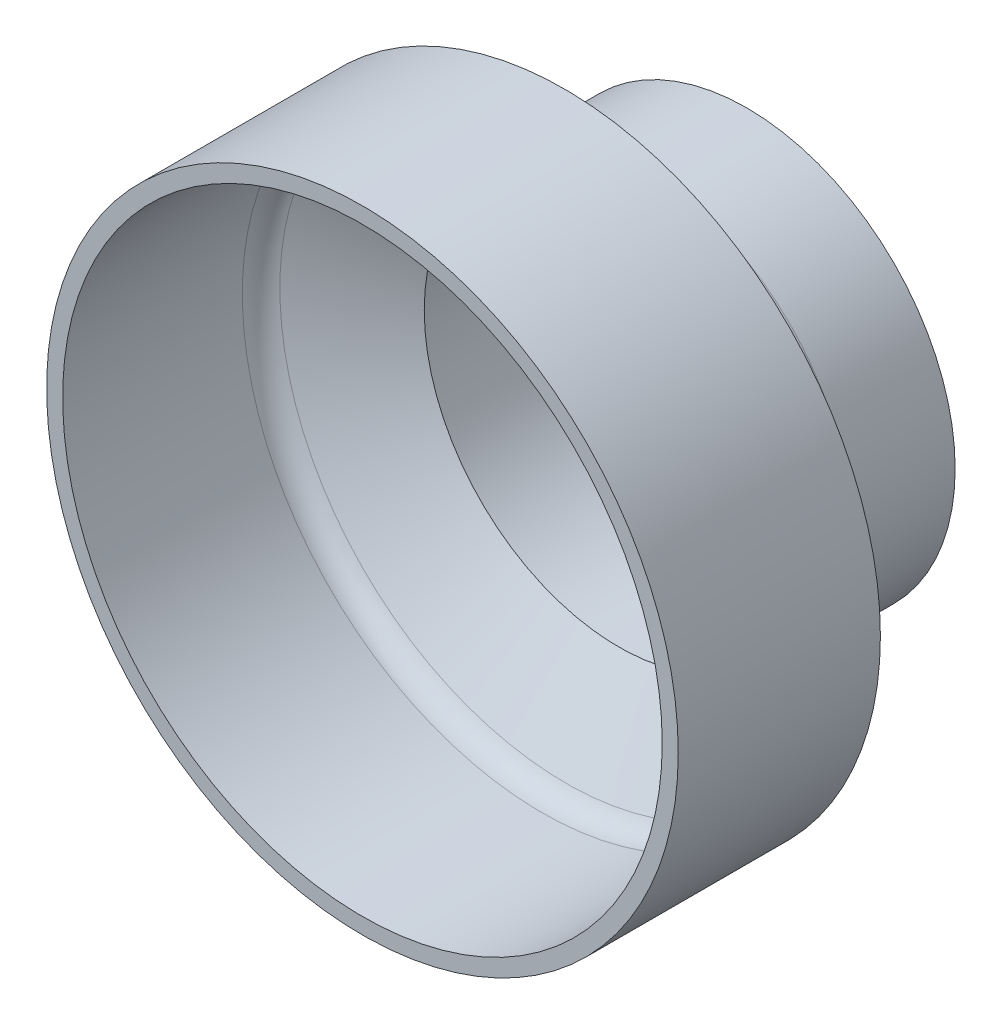
ISO-10303-21;
HEADER;
FILE_DESCRIPTION(('STEP AP214'),'2;1');
FILE_NAME('part.step','',(''),(''),'','','');
FILE_SCHEMA(('AUTOMOTIVE_DESIGN { 1 0 10303 214 1 1 1 1 }'));
ENDSEC;
DATA;
#1=APPLICATION_CONTEXT('core data for automotive mechanical design processes');
#2=APPLICATION_PROTOCOL_DEFINITION('international standard','automotive_design',2000,#1);
#3=PRODUCT_CONTEXT('',#1,'mechanical');
#4=PRODUCT('Part','Part','',(#3));
#5=PRODUCT_RELATED_PRODUCT_CATEGORY('part','',(#4));
#6=PRODUCT_DEFINITION_FORMATION('','',#4);
#7=PRODUCT_DEFINITION_CONTEXT('part definition',#1,'design');
#8=PRODUCT_DEFINITION('design','',#6,#7);
#9=PRODUCT_DEFINITION_SHAPE('','',#8);
#10=(LENGTH_UNIT() NAMED_UNIT(*) SI_UNIT(.MILLI.,.METRE.));
#11=(NAMED_UNIT(*) PLANE_ANGLE_UNIT() SI_UNIT($,.RADIAN.));
#12=(NAMED_UNIT(*) SI_UNIT($,.STERADIAN.) SOLID_ANGLE_UNIT());
#13=UNCERTAINTY_MEASURE_WITH_UNIT(LENGTH_MEASURE(1.E-05),#10,'distance_accuracy_value','');
#14=(GEOMETRIC_REPRESENTATION_CONTEXT(3) GLOBAL_UNCERTAINTY_ASSIGNED_CONTEXT((#13)) GLOBAL_UNIT_ASSIGNED_CONTEXT((#10,
#11,#12)) REPRESENTATION_CONTEXT('',''));
#15=CARTESIAN_POINT('',(0.,0.,0.));
#16=DIRECTION('',(0.,0.,1.));
#17=DIRECTION('',(1.,0.,0.));
#18=AXIS2_PLACEMENT_3D('',#15,#16,#17);
#19=CARTESIAN_POINT('',(0.,0.,0.));
#20=DIRECTION('',(0.,0.,1.));
#21=DIRECTION('',(1.,0.,0.));
#22=AXIS2_PLACEMENT_3D('',#19,#20,#21);
#23=CYLINDRICAL_SURFACE('',#22,6.35);
#24=CARTESIAN_POINT('',(0.,0.,0.762));
#25=DIRECTION('',(0.,0.,1.));
#26=DIRECTION('',(1.,0.,0.));
#27=AXIS2_PLACEMENT_3D('',#24,#25,#26);
#28=CIRCLE('',#27,6.35);
#29=CARTESIAN_POINT('',(6.35,0.,0.762));
#30=VERTEX_POINT('',#29);
#31=EDGE_CURVE('E70',#30,#30,#28,.T.);
#32=ORIENTED_EDGE('',*,*,#31,.T.);
#33=EDGE_LOOP('',(#32));
#34=FACE_BOUND('',#33,.T.);
#35=CARTESIAN_POINT('',(0.,0.,0.));
#36=DIRECTION('',(0.,0.,1.));
#37=DIRECTION('',(1.,0.,0.));
#38=AXIS2_PLACEMENT_3D('',#35,#36,#37);
#39=CIRCLE('',#38,6.35);
#40=CARTESIAN_POINT('',(6.35,0.,0.));
#41=VERTEX_POINT('',#40);
#42=EDGE_CURVE('E10',#41,#41,#39,.T.);
#43=ORIENTED_EDGE('',*,*,#42,.F.);
#44=EDGE_LOOP('',(#43));
#45=FACE_BOUND('',#44,.T.);
#46=ADVANCED_FACE('F30',(#34,#45),#23,.F.);
#47=CARTESIAN_POINT('',(11.557,0.,0.));
#48=DIRECTION('',(0.,0.,-1.));
#49=DIRECTION('',(-1.,0.,0.));
#50=AXIS2_PLACEMENT_3D('',#47,#48,#49);
#51=PLANE('',#50);
#52=ORIENTED_EDGE('',*,*,#42,.T.);
#53=EDGE_LOOP('',(#52));
#54=FACE_BOUND('',#53,.T.);
#55=CARTESIAN_POINT('',(0.,0.,0.));
#56=DIRECTION('',(0.,0.,1.));
#57=DIRECTION('',(1.,0.,0.));
#58=AXIS2_PLACEMENT_3D('',#55,#56,#57);
#59=CIRCLE('',#58,11.557);
#60=CARTESIAN_POINT('',(11.557,0.,0.));
#61=VERTEX_POINT('',#60);
#62=EDGE_CURVE('E36',#61,#61,#59,.T.);
#63=ORIENTED_EDGE('',*,*,#62,.F.);
#64=EDGE_LOOP('',(#63));
#65=FACE_BOUND('',#64,.T.);
#66=ADVANCED_FACE('F88',(#54,#65),#51,.T.);
#67=CARTESIAN_POINT('',(0.,0.,0.));
#68=DIRECTION('',(0.,0.,1.));
#69=DIRECTION('',(1.,0.,0.));
#70=AXIS2_PLACEMENT_3D('',#67,#68,#69);
#71=CYLINDRICAL_SURFACE('',#70,11.557);
#72=ORIENTED_EDGE('',*,*,#62,.T.);
#73=EDGE_LOOP('',(#72));
#74=FACE_BOUND('',#73,.T.);
#75=CARTESIAN_POINT('',(0.,0.,5.79217728463252));
#76=DIRECTION('',(0.,0.,1.));
#77=DIRECTION('',(1.,0.,0.));
#78=AXIS2_PLACEMENT_3D('',#75,#76,#77);
#79=CIRCLE('',#78,11.557);
#80=CARTESIAN_POINT('',(11.557,0.,5.79217728463252));
#81=VERTEX_POINT('',#80);
#82=EDGE_CURVE('E40',#81,#81,#79,.T.);
#83=ORIENTED_EDGE('',*,*,#82,.F.);
#84=EDGE_LOOP('',(#83));
#85=FACE_BOUND('',#84,.T.);
#86=ADVANCED_FACE('F92',(#74,#85),#71,.T.);
#87=CARTESIAN_POINT('',(0.,0.,5.79217728463252));
#88=DIRECTION('',(0.,0.,1.));
#89=DIRECTION('',(1.,0.,0.));
#90=AXIS2_PLACEMENT_3D('',#87,#88,#89);
#91=TOROIDAL_SURFACE('',#90,13.081,1.524);
#92=ORIENTED_EDGE('',*,*,#82,.T.);
#93=EDGE_LOOP('',(#92));
#94=FACE_BOUND('',#93,.T.);
#95=CARTESIAN_POINT('',(0.,0.,7.11200000000001));
#96=DIRECTION('',(0.,0.,1.));
#97=DIRECTION('',(1.,0.,0.));
#98=AXIS2_PLACEMENT_3D('',#95,#96,#97);
#99=CIRCLE('',#98,12.319);
#100=CARTESIAN_POINT('',(12.319,0.,7.11200000000001));
#101=VERTEX_POINT('',#100);
#102=EDGE_CURVE('E44',#101,#101,#99,.T.);
#103=ORIENTED_EDGE('',*,*,#102,.F.);
#104=EDGE_LOOP('',(#103));
#105=FACE_BOUND('',#104,.T.);
#106=ADVANCED_FACE('F96',(#94,#105),#91,.F.);
#107=CARTESIAN_POINT('',(0.,0.,10.1182628516704));
#108=DIRECTION('',(0.,0.,1.));
#109=DIRECTION('',(1.,0.,0.));
#110=AXIS2_PLACEMENT_3D('',#107,#108,#109);
#111=CONICAL_SURFACE('',#110,17.526,1.0471975511966);
#112=ORIENTED_EDGE('',*,*,#102,.T.);
#113=EDGE_LOOP('',(#112));
#114=FACE_BOUND('',#113,.T.);
#115=CARTESIAN_POINT('',(0.,0.,10.1182628516704));
#116=DIRECTION('',(0.,0.,1.));
#117=DIRECTION('',(1.,0.,0.));
#118=AXIS2_PLACEMENT_3D('',#115,#116,#117);
#119=CIRCLE('',#118,17.526);
#120=CARTESIAN_POINT('',(17.526,0.,10.1182628516704));
#121=VERTEX_POINT('',#120);
#122=EDGE_CURVE('E49',#121,#121,#119,.T.);
#123=ORIENTED_EDGE('',*,*,#122,.F.);
#124=EDGE_LOOP('',(#123));
#125=FACE_BOUND('',#124,.T.);
#126=ADVANCED_FACE('F102',(#114,#125),#111,.T.);
#127=CARTESIAN_POINT('',(0.,0.,0.));
#128=DIRECTION('',(0.,0.,1.));
#129=DIRECTION('',(1.,0.,0.));
#130=AXIS2_PLACEMENT_3D('',#127,#128,#129);
#131=CYLINDRICAL_SURFACE('',#130,17.526);
#132=ORIENTED_EDGE('',*,*,#122,.T.);
#133=EDGE_LOOP('',(#132));
#134=FACE_BOUND('',#133,.T.);
#135=CARTESIAN_POINT('',(0.,0.,21.336));
#136=DIRECTION('',(0.,0.,1.));
#137=DIRECTION('',(1.,0.,0.));
#138=AXIS2_PLACEMENT_3D('',#135,#136,#137);
#139=CIRCLE('',#138,17.526);
#140=CARTESIAN_POINT('',(17.526,0.,21.336));
#141=VERTEX_POINT('',#140);
#142=EDGE_CURVE('E52',#141,#141,#139,.T.);
#143=ORIENTED_EDGE('',*,*,#142,.F.);
#144=EDGE_LOOP('',(#143));
#145=FACE_BOUND('',#144,.T.);
#146=ADVANCED_FACE('F106',(#134,#145),#131,.T.);
#147=CARTESIAN_POINT('',(16.637,0.,21.336));
#148=DIRECTION('',(0.,0.,1.));
#149=DIRECTION('',(1.,0.,0.));
#150=AXIS2_PLACEMENT_3D('',#147,#148,#149);
#151=PLANE('',#150);
#152=ORIENTED_EDGE('',*,*,#142,.T.);
#153=EDGE_LOOP('',(#152));
#154=FACE_BOUND('',#153,.T.);
#155=CARTESIAN_POINT('',(0.,0.,21.336));
#156=DIRECTION('',(0.,0.,1.));
#157=DIRECTION('',(1.,0.,0.));
#158=AXIS2_PLACEMENT_3D('',#155,#156,#157);
#159=CIRCLE('',#158,16.637);
#160=CARTESIAN_POINT('',(16.637,0.,21.336));
#161=VERTEX_POINT('',#160);
#162=EDGE_CURVE('E55',#161,#161,#159,.T.);
#163=ORIENTED_EDGE('',*,*,#162,.F.);
#164=EDGE_LOOP('',(#163));
#165=FACE_BOUND('',#164,.T.);
#166=ADVANCED_FACE('F110',(#154,#165),#151,.T.);
#167=CARTESIAN_POINT('',(0.,0.,0.));
#168=DIRECTION('',(0.,0.,1.));
#169=DIRECTION('',(1.,0.,0.));
#170=AXIS2_PLACEMENT_3D('',#167,#168,#169);
#171=CYLINDRICAL_SURFACE('',#170,16.637);
#172=ORIENTED_EDGE('',*,*,#162,.T.);
#173=EDGE_LOOP('',(#172));
#174=FACE_BOUND('',#173,.T.);
#175=CARTESIAN_POINT('',(0.,0.,11.3647620828508));
#176=DIRECTION('',(0.,0.,1.));
#177=DIRECTION('',(1.,0.,0.));
#178=AXIS2_PLACEMENT_3D('',#175,#176,#177);
#179=CIRCLE('',#178,16.637);
#180=CARTESIAN_POINT('',(16.637,0.,11.3647620828508));
#181=VERTEX_POINT('',#180);
#182=EDGE_CURVE('E58',#181,#181,#179,.T.);
#183=ORIENTED_EDGE('',*,*,#182,.F.);
#184=EDGE_LOOP('',(#183));
#185=FACE_BOUND('',#184,.T.);
#186=ADVANCED_FACE('F114',(#174,#185),#171,.F.);
#187=CARTESIAN_POINT('',(0.,0.,11.3647620828508));
#188=DIRECTION('',(0.,0.,1.));
#189=DIRECTION('',(1.,0.,0.));
#190=AXIS2_PLACEMENT_3D('',#187,#188,#189);
#191=TOROIDAL_SURFACE('',#190,15.113,1.524);
#192=ORIENTED_EDGE('',*,*,#182,.T.);
#193=EDGE_LOOP('',(#192));
#194=FACE_BOUND('',#193,.T.);
#195=CARTESIAN_POINT('',(0.,0.,10.0449393674833));
#196=DIRECTION('',(0.,0.,1.));
#197=DIRECTION('',(1.,0.,0.));
#198=AXIS2_PLACEMENT_3D('',#195,#196,#197);
#199=CIRCLE('',#198,15.875);
#200=CARTESIAN_POINT('',(15.875,0.,10.0449393674833));
#201=VERTEX_POINT('',#200);
#202=EDGE_CURVE('E61',#201,#201,#199,.T.);
#203=ORIENTED_EDGE('',*,*,#202,.F.);
#204=EDGE_LOOP('',(#203));
#205=FACE_BOUND('',#204,.T.);
#206=ADVANCED_FACE('F118',(#194,#205),#191,.F.);
#207=CARTESIAN_POINT('',(0.,0.,7.112));
#208=DIRECTION('',(0.,0.,1.));
#209=DIRECTION('',(1.,0.,0.));
#210=AXIS2_PLACEMENT_3D('',#207,#208,#209);
#211=CONICAL_SURFACE('',#210,10.795,1.0471975511966);
#212=ORIENTED_EDGE('',*,*,#202,.T.);
#213=EDGE_LOOP('',(#212));
#214=FACE_BOUND('',#213,.T.);
#215=CARTESIAN_POINT('',(0.,0.,7.112));
#216=DIRECTION('',(0.,0.,1.));
#217=DIRECTION('',(1.,0.,0.));
#218=AXIS2_PLACEMENT_3D('',#215,#216,#217);
#219=CIRCLE('',#218,10.795);
#220=CARTESIAN_POINT('',(10.795,0.,7.112));
#221=VERTEX_POINT('',#220);
#222=EDGE_CURVE('E64',#221,#221,#219,.T.);
#223=ORIENTED_EDGE('',*,*,#222,.F.);
#224=EDGE_LOOP('',(#223));
#225=FACE_BOUND('',#224,.T.);
#226=ADVANCED_FACE('F84',(#214,#225),#211,.F.);
#227=CARTESIAN_POINT('',(0.,0.,0.));
#228=DIRECTION('',(0.,0.,1.));
#229=DIRECTION('',(1.,0.,0.));
#230=AXIS2_PLACEMENT_3D('',#227,#228,#229);
#231=CYLINDRICAL_SURFACE('',#230,10.795);
#232=ORIENTED_EDGE('',*,*,#222,.T.);
#233=EDGE_LOOP('',(#232));
#234=FACE_BOUND('',#233,.T.);
#235=CARTESIAN_POINT('',(0.,0.,0.762000000000001));
#236=DIRECTION('',(0.,0.,1.));
#237=DIRECTION('',(1.,0.,0.));
#238=AXIS2_PLACEMENT_3D('',#235,#236,#237);
#239=CIRCLE('',#238,10.795);
#240=CARTESIAN_POINT('',(10.795,0.,0.762000000000001));
#241=VERTEX_POINT('',#240);
#242=EDGE_CURVE('E67',#241,#241,#239,.T.);
#243=ORIENTED_EDGE('',*,*,#242,.F.);
#244=EDGE_LOOP('',(#243));
#245=FACE_BOUND('',#244,.T.);
#246=ADVANCED_FACE('F78',(#234,#245),#231,.F.);
#247=CARTESIAN_POINT('',(6.35,0.,0.762));
#248=DIRECTION('',(0.,0.,1.));
#249=DIRECTION('',(1.,0.,0.));
#250=AXIS2_PLACEMENT_3D('',#247,#248,#249);
#251=PLANE('',#250);
#252=ORIENTED_EDGE('',*,*,#242,.T.);
#253=EDGE_LOOP('',(#252));
#254=FACE_BOUND('',#253,.T.);
#255=ORIENTED_EDGE('',*,*,#31,.F.);
#256=EDGE_LOOP('',(#255));
#257=FACE_BOUND('',#256,.T.);
#258=ADVANCED_FACE('F76',(#254,#257),#251,.T.);
#259=CLOSED_SHELL('',(#46,#66,#86,#106,#126,#146,#166,#186,#206,#226,#246,#258));
#260=MANIFOLD_SOLID_BREP('B2',#259);
#261=ADVANCED_BREP_SHAPE_REPRESENTATION('',(#18,#260),#14);
#262=SHAPE_DEFINITION_REPRESENTATION(#9,#261);
ENDSEC;
END-ISO-10303-21;
